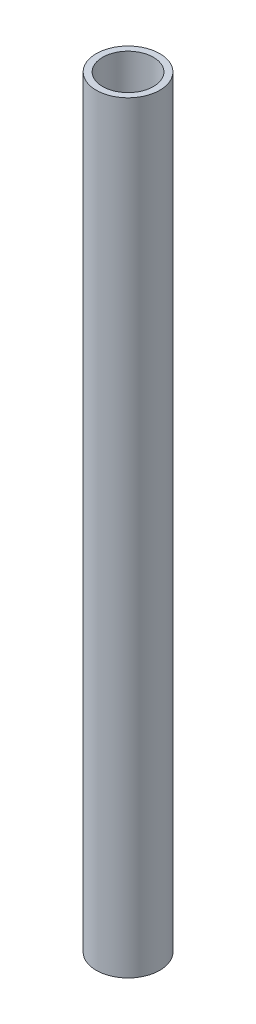
ISO-10303-21;
HEADER;
FILE_DESCRIPTION(('STEP AP214'),'2;1');
FILE_NAME('part.step','',(''),(''),'','','');
FILE_SCHEMA(('AUTOMOTIVE_DESIGN { 1 0 10303 214 1 1 1 1 }'));
ENDSEC;
DATA;
#1=APPLICATION_CONTEXT('core data for automotive mechanical design processes');
#2=APPLICATION_PROTOCOL_DEFINITION('international standard','automotive_design',2000,#1);
#3=PRODUCT_CONTEXT('',#1,'mechanical');
#4=PRODUCT('Part','Part','',(#3));
#5=PRODUCT_RELATED_PRODUCT_CATEGORY('part','',(#4));
#6=PRODUCT_DEFINITION_FORMATION('','',#4);
#7=PRODUCT_DEFINITION_CONTEXT('part definition',#1,'design');
#8=PRODUCT_DEFINITION('design','',#6,#7);
#9=PRODUCT_DEFINITION_SHAPE('','',#8);
#10=(LENGTH_UNIT() NAMED_UNIT(*) SI_UNIT(.MILLI.,.METRE.));
#11=(NAMED_UNIT(*) PLANE_ANGLE_UNIT() SI_UNIT($,.RADIAN.));
#12=(NAMED_UNIT(*) SI_UNIT($,.STERADIAN.) SOLID_ANGLE_UNIT());
#13=UNCERTAINTY_MEASURE_WITH_UNIT(LENGTH_MEASURE(1.E-05),#10,'distance_accuracy_value','');
#14=(GEOMETRIC_REPRESENTATION_CONTEXT(3) GLOBAL_UNCERTAINTY_ASSIGNED_CONTEXT((#13)) GLOBAL_UNIT_ASSIGNED_CONTEXT((#10,
#11,#12)) REPRESENTATION_CONTEXT('',''));
#15=CARTESIAN_POINT('',(0.,0.,0.));
#16=DIRECTION('',(0.,0.,1.));
#17=DIRECTION('',(1.,0.,0.));
#18=AXIS2_PLACEMENT_3D('',#15,#16,#17);
#19=CARTESIAN_POINT('',(0.,0.,0.));
#20=DIRECTION('',(0.,-1.,0.));
#21=DIRECTION('',(0.,0.,-1.));
#22=AXIS2_PLACEMENT_3D('',#19,#20,#21);
#23=CYLINDRICAL_SURFACE('',#22,10.);
#24=CARTESIAN_POINT('',(0.,-67.5310623950249,0.));
#25=DIRECTION('',(0.,-1.,0.));
#26=DIRECTION('',(0.,0.,-1.));
#27=AXIS2_PLACEMENT_3D('',#24,#25,#26);
#28=CIRCLE('',#27,10.);
#29=CARTESIAN_POINT('',(0.,-67.5310623950249,-10.));
#30=VERTEX_POINT('',#29);
#31=EDGE_CURVE('E46',#30,#30,#28,.T.);
#32=ORIENTED_EDGE('',*,*,#31,.T.);
#33=EDGE_LOOP('',(#32));
#34=FACE_BOUND('',#33,.T.);
#35=CARTESIAN_POINT('',(0.,232.468937604975,0.));
#36=DIRECTION('',(0.,-1.,0.));
#37=DIRECTION('',(0.,0.,-1.));
#38=AXIS2_PLACEMENT_3D('',#35,#36,#37);
#39=CIRCLE('',#38,10.);
#40=CARTESIAN_POINT('',(0.,232.468937604975,-10.));
#41=VERTEX_POINT('',#40);
#42=EDGE_CURVE('E10',#41,#41,#39,.T.);
#43=ORIENTED_EDGE('',*,*,#42,.F.);
#44=EDGE_LOOP('',(#43));
#45=FACE_BOUND('',#44,.T.);
#46=ADVANCED_FACE('F32',(#34,#45),#23,.F.);
#47=CARTESIAN_POINT('',(10.,232.468937604975,0.));
#48=DIRECTION('',(0.,1.,0.));
#49=DIRECTION('',(0.,0.,1.));
#50=AXIS2_PLACEMENT_3D('',#47,#48,#49);
#51=PLANE('',#50);
#52=ORIENTED_EDGE('',*,*,#42,.T.);
#53=EDGE_LOOP('',(#52));
#54=FACE_BOUND('',#53,.T.);
#55=CARTESIAN_POINT('',(0.,232.468937604975,0.));
#56=DIRECTION('',(0.,-1.,0.));
#57=DIRECTION('',(0.,0.,-1.));
#58=AXIS2_PLACEMENT_3D('',#55,#56,#57);
#59=CIRCLE('',#58,12.5);
#60=CARTESIAN_POINT('',(0.,232.468937604975,-12.5));
#61=VERTEX_POINT('',#60);
#62=EDGE_CURVE('E38',#61,#61,#59,.T.);
#63=ORIENTED_EDGE('',*,*,#62,.F.);
#64=EDGE_LOOP('',(#63));
#65=FACE_BOUND('',#64,.T.);
#66=ADVANCED_FACE('F62',(#54,#65),#51,.T.);
#67=CARTESIAN_POINT('',(0.,0.,0.));
#68=DIRECTION('',(0.,-1.,0.));
#69=DIRECTION('',(0.,0.,-1.));
#70=AXIS2_PLACEMENT_3D('',#67,#68,#69);
#71=CYLINDRICAL_SURFACE('',#70,12.5);
#72=ORIENTED_EDGE('',*,*,#62,.T.);
#73=EDGE_LOOP('',(#72));
#74=FACE_BOUND('',#73,.T.);
#75=CARTESIAN_POINT('',(0.,-67.5310623950249,0.));
#76=DIRECTION('',(0.,-1.,0.));
#77=DIRECTION('',(0.,0.,-1.));
#78=AXIS2_PLACEMENT_3D('',#75,#76,#77);
#79=CIRCLE('',#78,12.5);
#80=CARTESIAN_POINT('',(0.,-67.5310623950249,-12.5));
#81=VERTEX_POINT('',#80);
#82=EDGE_CURVE('E42',#81,#81,#79,.T.);
#83=ORIENTED_EDGE('',*,*,#82,.F.);
#84=EDGE_LOOP('',(#83));
#85=FACE_BOUND('',#84,.T.);
#86=ADVANCED_FACE('F56',(#74,#85),#71,.T.);
#87=CARTESIAN_POINT('',(10.,-67.5310623950249,0.));
#88=DIRECTION('',(0.,-1.,0.));
#89=DIRECTION('',(0.,0.,-1.));
#90=AXIS2_PLACEMENT_3D('',#87,#88,#89);
#91=PLANE('',#90);
#92=ORIENTED_EDGE('',*,*,#82,.T.);
#93=EDGE_LOOP('',(#92));
#94=FACE_BOUND('',#93,.T.);
#95=ORIENTED_EDGE('',*,*,#31,.F.);
#96=EDGE_LOOP('',(#95));
#97=FACE_BOUND('',#96,.T.);
#98=ADVANCED_FACE('F54',(#94,#97),#91,.T.);
#99=CLOSED_SHELL('',(#46,#66,#86,#98));
#100=MANIFOLD_SOLID_BREP('B2',#99);
#101=ADVANCED_BREP_SHAPE_REPRESENTATION('',(#18,#100),#14);
#102=SHAPE_DEFINITION_REPRESENTATION(#9,#101);
ENDSEC;
END-ISO-10303-21;
